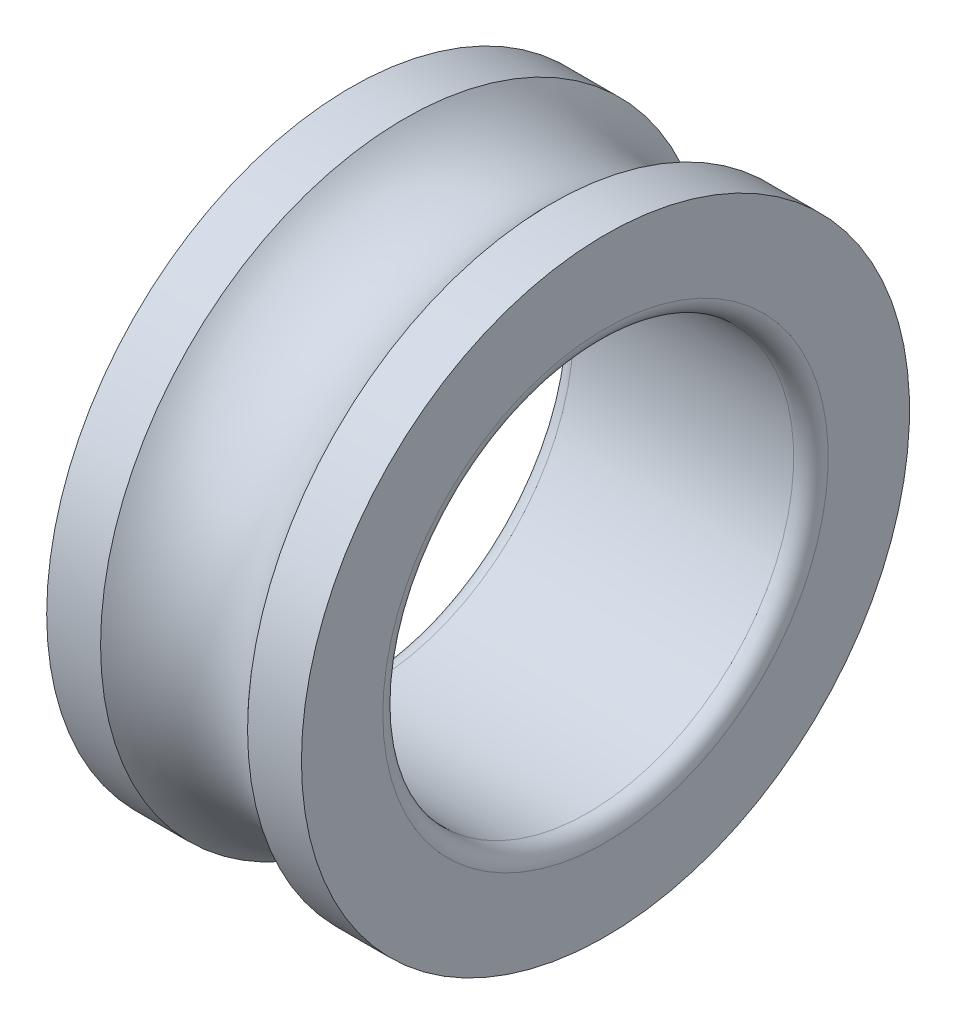
ISO-10303-21;
HEADER;
FILE_DESCRIPTION(('STEP AP214'),'2;1');
FILE_NAME('part.step','',(''),(''),'','','');
FILE_SCHEMA(('AUTOMOTIVE_DESIGN { 1 0 10303 214 1 1 1 1 }'));
ENDSEC;
DATA;
#1=APPLICATION_CONTEXT('core data for automotive mechanical design processes');
#2=APPLICATION_PROTOCOL_DEFINITION('international standard','automotive_design',2000,#1);
#3=PRODUCT_CONTEXT('',#1,'mechanical');
#4=PRODUCT('Part','Part','',(#3));
#5=PRODUCT_RELATED_PRODUCT_CATEGORY('part','',(#4));
#6=PRODUCT_DEFINITION_FORMATION('','',#4);
#7=PRODUCT_DEFINITION_CONTEXT('part definition',#1,'design');
#8=PRODUCT_DEFINITION('design','',#6,#7);
#9=PRODUCT_DEFINITION_SHAPE('','',#8);
#10=(LENGTH_UNIT() NAMED_UNIT(*) SI_UNIT(.MILLI.,.METRE.));
#11=(NAMED_UNIT(*) PLANE_ANGLE_UNIT() SI_UNIT($,.RADIAN.));
#12=(NAMED_UNIT(*) SI_UNIT($,.STERADIAN.) SOLID_ANGLE_UNIT());
#13=UNCERTAINTY_MEASURE_WITH_UNIT(LENGTH_MEASURE(1.E-05),#10,'distance_accuracy_value','');
#14=(GEOMETRIC_REPRESENTATION_CONTEXT(3) GLOBAL_UNCERTAINTY_ASSIGNED_CONTEXT((#13)) GLOBAL_UNIT_ASSIGNED_CONTEXT((#10,
#11,#12)) REPRESENTATION_CONTEXT('',''));
#15=CARTESIAN_POINT('',(0.,0.,0.));
#16=DIRECTION('',(0.,0.,1.));
#17=DIRECTION('',(1.,0.,0.));
#18=AXIS2_PLACEMENT_3D('',#15,#16,#17);
#19=CARTESIAN_POINT('',(-15.5,37.,0.));
#20=DIRECTION('',(1.,0.,0.));
#21=DIRECTION('',(0.,0.,-1.));
#22=AXIS2_PLACEMENT_3D('',#19,#20,#21);
#23=PLANE('',#22);
#24=CARTESIAN_POINT('',(-15.5,0.,0.));
#25=DIRECTION('',(-1.,0.,0.));
#26=DIRECTION('',(0.,0.,1.));
#27=AXIS2_PLACEMENT_3D('',#24,#25,#26);
#28=CIRCLE('',#27,27.1);
#29=CARTESIAN_POINT('',(-15.5,0.,27.1));
#30=VERTEX_POINT('',#29);
#31=EDGE_CURVE('E10',#30,#30,#28,.T.);
#32=ORIENTED_EDGE('',*,*,#31,.F.);
#33=EDGE_LOOP('',(#32));
#34=FACE_BOUND('',#33,.T.);
#35=CARTESIAN_POINT('',(-15.5,0.,0.));
#36=DIRECTION('',(-1.,0.,0.));
#37=DIRECTION('',(0.,0.,1.));
#38=AXIS2_PLACEMENT_3D('',#35,#36,#37);
#39=CIRCLE('',#38,37.);
#40=CARTESIAN_POINT('',(-15.5,0.,37.));
#41=VERTEX_POINT('',#40);
#42=EDGE_CURVE('E72',#41,#41,#39,.T.);
#43=ORIENTED_EDGE('',*,*,#42,.T.);
#44=EDGE_LOOP('',(#43));
#45=FACE_BOUND('',#44,.T.);
#46=ADVANCED_FACE('F37',(#34,#45),#23,.F.);
#47=CARTESIAN_POINT('',(-13.4,0.,0.));
#48=DIRECTION('',(-1.,0.,0.));
#49=DIRECTION('',(0.,0.,1.));
#50=AXIS2_PLACEMENT_3D('',#47,#48,#49);
#51=TOROIDAL_SURFACE('',#50,27.1,2.1);
#52=CARTESIAN_POINT('',(-13.4,0.,0.));
#53=DIRECTION('',(-1.,0.,0.));
#54=DIRECTION('',(0.,0.,1.));
#55=AXIS2_PLACEMENT_3D('',#52,#53,#54);
#56=CIRCLE('',#55,25.);
#57=CARTESIAN_POINT('',(-13.4,0.,25.));
#58=VERTEX_POINT('',#57);
#59=EDGE_CURVE('E44',#58,#58,#56,.T.);
#60=ORIENTED_EDGE('',*,*,#59,.F.);
#61=EDGE_LOOP('',(#60));
#62=FACE_BOUND('',#61,.T.);
#63=ORIENTED_EDGE('',*,*,#31,.T.);
#64=EDGE_LOOP('',(#63));
#65=FACE_BOUND('',#64,.T.);
#66=ADVANCED_FACE('F110',(#62,#65),#51,.T.);
#67=CARTESIAN_POINT('',(-23.4551934826884,0.,0.));
#68=DIRECTION('',(-1.,0.,0.));
#69=DIRECTION('',(0.,0.,1.));
#70=AXIS2_PLACEMENT_3D('',#67,#68,#69);
#71=CYLINDRICAL_SURFACE('',#70,25.);
#72=CARTESIAN_POINT('',(13.4,0.,0.));
#73=DIRECTION('',(-1.,0.,0.));
#74=DIRECTION('',(0.,0.,1.));
#75=AXIS2_PLACEMENT_3D('',#72,#73,#74);
#76=CIRCLE('',#75,25.);
#77=CARTESIAN_POINT('',(13.4,0.,25.));
#78=VERTEX_POINT('',#77);
#79=EDGE_CURVE('E49',#78,#78,#76,.T.);
#80=ORIENTED_EDGE('',*,*,#79,.F.);
#81=EDGE_LOOP('',(#80));
#82=FACE_BOUND('',#81,.T.);
#83=ORIENTED_EDGE('',*,*,#59,.T.);
#84=EDGE_LOOP('',(#83));
#85=FACE_BOUND('',#84,.T.);
#86=ADVANCED_FACE('F105',(#82,#85),#71,.F.);
#87=CARTESIAN_POINT('',(13.4,0.,0.));
#88=DIRECTION('',(-1.,0.,0.));
#89=DIRECTION('',(0.,0.,1.));
#90=AXIS2_PLACEMENT_3D('',#87,#88,#89);
#91=TOROIDAL_SURFACE('',#90,27.1,2.1);
#92=CARTESIAN_POINT('',(15.5,0.,0.));
#93=DIRECTION('',(-1.,0.,0.));
#94=DIRECTION('',(0.,0.,1.));
#95=AXIS2_PLACEMENT_3D('',#92,#93,#94);
#96=CIRCLE('',#95,27.1);
#97=CARTESIAN_POINT('',(15.5,0.,27.1));
#98=VERTEX_POINT('',#97);
#99=EDGE_CURVE('E54',#98,#98,#96,.T.);
#100=ORIENTED_EDGE('',*,*,#99,.F.);
#101=EDGE_LOOP('',(#100));
#102=FACE_BOUND('',#101,.T.);
#103=ORIENTED_EDGE('',*,*,#79,.T.);
#104=EDGE_LOOP('',(#103));
#105=FACE_BOUND('',#104,.T.);
#106=ADVANCED_FACE('F99',(#102,#105),#91,.T.);
#107=CARTESIAN_POINT('',(15.5,37.,0.));
#108=DIRECTION('',(-1.,0.,0.));
#109=DIRECTION('',(0.,0.,1.));
#110=AXIS2_PLACEMENT_3D('',#107,#108,#109);
#111=PLANE('',#110);
#112=CARTESIAN_POINT('',(15.5,0.,0.));
#113=DIRECTION('',(-1.,0.,0.));
#114=DIRECTION('',(0.,0.,1.));
#115=AXIS2_PLACEMENT_3D('',#112,#113,#114);
#116=CIRCLE('',#115,37.);
#117=CARTESIAN_POINT('',(15.5,0.,37.));
#118=VERTEX_POINT('',#117);
#119=EDGE_CURVE('E60',#118,#118,#116,.T.);
#120=ORIENTED_EDGE('',*,*,#119,.F.);
#121=EDGE_LOOP('',(#120));
#122=FACE_BOUND('',#121,.T.);
#123=ORIENTED_EDGE('',*,*,#99,.T.);
#124=EDGE_LOOP('',(#123));
#125=FACE_BOUND('',#124,.T.);
#126=ADVANCED_FACE('F93',(#122,#125),#111,.F.);
#127=CARTESIAN_POINT('',(-23.4551934826884,0.,0.));
#128=DIRECTION('',(-1.,0.,0.));
#129=DIRECTION('',(0.,0.,1.));
#130=AXIS2_PLACEMENT_3D('',#127,#128,#129);
#131=CYLINDRICAL_SURFACE('',#130,37.);
#132=CARTESIAN_POINT('',(8.94427190999916,0.,0.));
#133=DIRECTION('',(-1.,0.,0.));
#134=DIRECTION('',(0.,0.,1.));
#135=AXIS2_PLACEMENT_3D('',#132,#133,#134);
#136=CIRCLE('',#135,37.);
#137=CARTESIAN_POINT('',(8.94427190999916,0.,37.));
#138=VERTEX_POINT('',#137);
#139=EDGE_CURVE('E64',#138,#138,#136,.T.);
#140=ORIENTED_EDGE('',*,*,#139,.F.);
#141=EDGE_LOOP('',(#140));
#142=FACE_BOUND('',#141,.T.);
#143=ORIENTED_EDGE('',*,*,#119,.T.);
#144=EDGE_LOOP('',(#143));
#145=FACE_BOUND('',#144,.T.);
#146=ADVANCED_FACE('F87',(#142,#145),#131,.T.);
#147=CARTESIAN_POINT('',(0.,0.,0.));
#148=DIRECTION('',(-1.,0.,0.));
#149=DIRECTION('',(0.,0.,1.));
#150=AXIS2_PLACEMENT_3D('',#147,#148,#149);
#151=TOROIDAL_SURFACE('',#150,45.,12.);
#152=CARTESIAN_POINT('',(-8.94427190999917,0.,0.));
#153=DIRECTION('',(-1.,0.,0.));
#154=DIRECTION('',(0.,0.,1.));
#155=AXIS2_PLACEMENT_3D('',#152,#153,#154);
#156=CIRCLE('',#155,37.);
#157=CARTESIAN_POINT('',(-8.94427190999917,0.,37.));
#158=VERTEX_POINT('',#157);
#159=EDGE_CURVE('E68',#158,#158,#156,.T.);
#160=ORIENTED_EDGE('',*,*,#159,.F.);
#161=EDGE_LOOP('',(#160));
#162=FACE_BOUND('',#161,.T.);
#163=ORIENTED_EDGE('',*,*,#139,.T.);
#164=EDGE_LOOP('',(#163));
#165=FACE_BOUND('',#164,.T.);
#166=ADVANCED_FACE('F81',(#162,#165),#151,.F.);
#167=CARTESIAN_POINT('',(-23.4551934826884,0.,0.));
#168=DIRECTION('',(-1.,0.,0.));
#169=DIRECTION('',(0.,0.,1.));
#170=AXIS2_PLACEMENT_3D('',#167,#168,#169);
#171=CYLINDRICAL_SURFACE('',#170,37.);
#172=ORIENTED_EDGE('',*,*,#42,.F.);
#173=EDGE_LOOP('',(#172));
#174=FACE_BOUND('',#173,.T.);
#175=ORIENTED_EDGE('',*,*,#159,.T.);
#176=EDGE_LOOP('',(#175));
#177=FACE_BOUND('',#176,.T.);
#178=ADVANCED_FACE('F78',(#174,#177),#171,.T.);
#179=CLOSED_SHELL('',(#46,#66,#86,#106,#126,#146,#166,#178));
#180=MANIFOLD_SOLID_BREP('B2',#179);
#181=ADVANCED_BREP_SHAPE_REPRESENTATION('',(#18,#180),#14);
#182=SHAPE_DEFINITION_REPRESENTATION(#9,#181);
ENDSEC;
END-ISO-10303-21;
